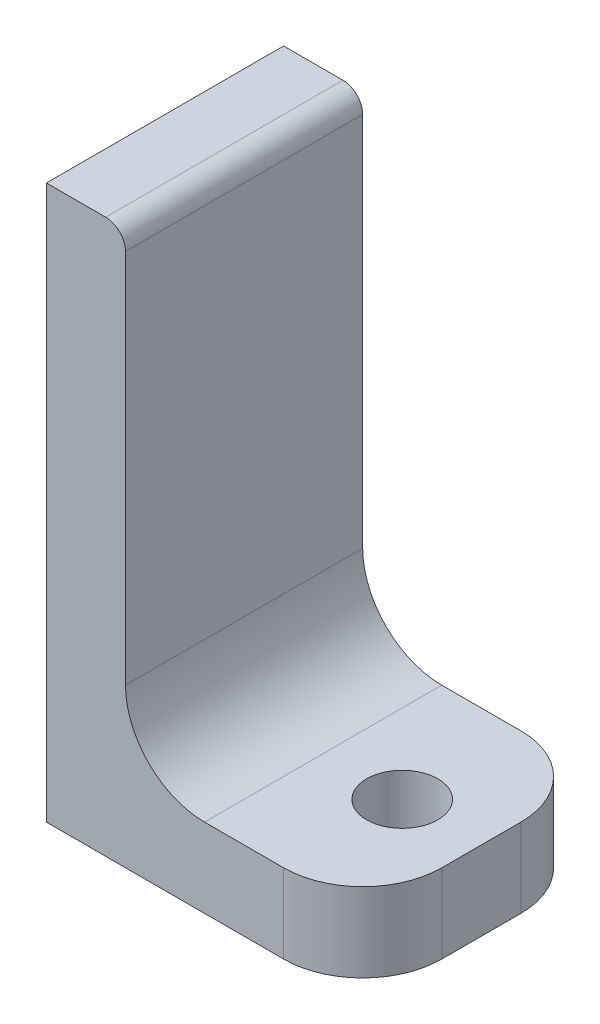
ISO-10303-21;
HEADER;
FILE_DESCRIPTION(('STEP AP214'),'2;1');
FILE_NAME('part.step','',(''),(''),'','','');
FILE_SCHEMA(('AUTOMOTIVE_DESIGN { 1 0 10303 214 1 1 1 1 }'));
ENDSEC;
DATA;
#1=APPLICATION_CONTEXT('core data for automotive mechanical design processes');
#2=APPLICATION_PROTOCOL_DEFINITION('international standard','automotive_design',2000,#1);
#3=PRODUCT_CONTEXT('',#1,'mechanical');
#4=PRODUCT('Part','Part','',(#3));
#5=PRODUCT_RELATED_PRODUCT_CATEGORY('part','',(#4));
#6=PRODUCT_DEFINITION_FORMATION('','',#4);
#7=PRODUCT_DEFINITION_CONTEXT('part definition',#1,'design');
#8=PRODUCT_DEFINITION('design','',#6,#7);
#9=PRODUCT_DEFINITION_SHAPE('','',#8);
#10=(LENGTH_UNIT() NAMED_UNIT(*) SI_UNIT(.MILLI.,.METRE.));
#11=(NAMED_UNIT(*) PLANE_ANGLE_UNIT() SI_UNIT($,.RADIAN.));
#12=(NAMED_UNIT(*) SI_UNIT($,.STERADIAN.) SOLID_ANGLE_UNIT());
#13=UNCERTAINTY_MEASURE_WITH_UNIT(LENGTH_MEASURE(1.E-05),#10,'distance_accuracy_value','');
#14=(GEOMETRIC_REPRESENTATION_CONTEXT(3) GLOBAL_UNCERTAINTY_ASSIGNED_CONTEXT((#13)) GLOBAL_UNIT_ASSIGNED_CONTEXT((#10,
#11,#12)) REPRESENTATION_CONTEXT('',''));
#15=CARTESIAN_POINT('',(0.,0.,0.));
#16=DIRECTION('',(0.,0.,1.));
#17=DIRECTION('',(1.,0.,0.));
#18=AXIS2_PLACEMENT_3D('',#15,#16,#17);
#19=CARTESIAN_POINT('',(0.,35.,15.));
#20=DIRECTION('',(0.,1.,0.));
#21=DIRECTION('',(0.,0.,1.));
#22=AXIS2_PLACEMENT_3D('',#19,#20,#21);
#23=PLANE('',#22);
#24=DIRECTION('',(1.,0.,0.));
#25=VECTOR('',#24,1.);
#26=CARTESIAN_POINT('',(0.,35.,0.));
#27=LINE('',#26,#25);
#28=CARTESIAN_POINT('',(0.,35.,0.));
#29=VERTEX_POINT('',#28);
#30=CARTESIAN_POINT('',(3.75,35.,0.));
#31=VERTEX_POINT('',#30);
#32=EDGE_CURVE('E166',#29,#31,#27,.T.);
#33=ORIENTED_EDGE('',*,*,#32,.F.);
#34=DIRECTION('',(0.,0.,-1.));
#35=VECTOR('',#34,1.);
#36=CARTESIAN_POINT('',(0.,35.,15.));
#37=LINE('',#36,#35);
#38=CARTESIAN_POINT('',(0.,35.,15.));
#39=VERTEX_POINT('',#38);
#40=EDGE_CURVE('E141',#39,#29,#37,.T.);
#41=ORIENTED_EDGE('',*,*,#40,.F.);
#42=DIRECTION('',(1.,0.,0.));
#43=VECTOR('',#42,1.);
#44=CARTESIAN_POINT('',(0.,35.,15.));
#45=LINE('',#44,#43);
#46=CARTESIAN_POINT('',(3.75,35.,15.));
#47=VERTEX_POINT('',#46);
#48=EDGE_CURVE('E121',#39,#47,#45,.T.);
#49=ORIENTED_EDGE('',*,*,#48,.T.);
#50=DIRECTION('',(0.,0.,-1.));
#51=VECTOR('',#50,1.);
#52=CARTESIAN_POINT('',(3.75,35.,15.));
#53=LINE('',#52,#51);
#54=EDGE_CURVE('E130',#47,#31,#53,.T.);
#55=ORIENTED_EDGE('',*,*,#54,.T.);
#56=EDGE_LOOP('',(#33,#41,#49,#55));
#57=FACE_BOUND('',#56,.T.);
#58=ADVANCED_FACE('F39',(#57),#23,.T.);
#59=CARTESIAN_POINT('',(0.,35.,15.));
#60=DIRECTION('',(1.,0.,0.));
#61=DIRECTION('',(0.,1.,0.));
#62=AXIS2_PLACEMENT_3D('',#59,#60,#61);
#63=PLANE('',#62);
#64=DIRECTION('',(0.,-1.,0.));
#65=VECTOR('',#64,1.);
#66=CARTESIAN_POINT('',(0.,35.,0.));
#67=LINE('',#66,#65);
#68=CARTESIAN_POINT('',(0.,0.,0.));
#69=VERTEX_POINT('',#68);
#70=EDGE_CURVE('E144',#29,#69,#67,.T.);
#71=ORIENTED_EDGE('',*,*,#70,.T.);
#72=DIRECTION('',(0.,0.,-1.));
#73=VECTOR('',#72,1.);
#74=CARTESIAN_POINT('',(0.,0.,15.));
#75=LINE('',#74,#73);
#76=CARTESIAN_POINT('',(0.,0.,15.));
#77=VERTEX_POINT('',#76);
#78=EDGE_CURVE('E186',#77,#69,#75,.T.);
#79=ORIENTED_EDGE('',*,*,#78,.F.);
#80=DIRECTION('',(0.,-1.,0.));
#81=VECTOR('',#80,1.);
#82=CARTESIAN_POINT('',(0.,35.,15.));
#83=LINE('',#82,#81);
#84=EDGE_CURVE('E139',#39,#77,#83,.T.);
#85=ORIENTED_EDGE('',*,*,#84,.F.);
#86=ORIENTED_EDGE('',*,*,#40,.T.);
#87=EDGE_LOOP('',(#71,#79,#85,#86));
#88=FACE_BOUND('',#87,.T.);
#89=ADVANCED_FACE('F247',(#88),#63,.F.);
#90=CARTESIAN_POINT('',(0.,0.,15.));
#91=DIRECTION('',(0.,1.,0.));
#92=DIRECTION('',(0.,0.,1.));
#93=AXIS2_PLACEMENT_3D('',#90,#91,#92);
#94=PLANE('',#93);
#95=CARTESIAN_POINT('',(15.,0.,7.5));
#96=DIRECTION('',(0.,1.,0.));
#97=DIRECTION('',(0.,0.,1.));
#98=AXIS2_PLACEMENT_3D('',#95,#96,#97);
#99=CIRCLE('',#98,2.25);
#100=CARTESIAN_POINT('',(15.,0.,9.75));
#101=VERTEX_POINT('',#100);
#102=EDGE_CURVE('E150',#101,#101,#99,.F.);
#103=ORIENTED_EDGE('',*,*,#102,.F.);
#104=EDGE_LOOP('',(#103));
#105=FACE_BOUND('',#104,.T.);
#106=DIRECTION('',(1.,0.,0.));
#107=VECTOR('',#106,1.);
#108=CARTESIAN_POINT('',(0.,0.,0.));
#109=LINE('',#108,#107);
#110=CARTESIAN_POINT('',(15.,0.,0.));
#111=VERTEX_POINT('',#110);
#112=EDGE_CURVE('E147',#69,#111,#109,.T.);
#113=ORIENTED_EDGE('',*,*,#112,.T.);
#114=CARTESIAN_POINT('',(15.,0.,5.));
#115=DIRECTION('',(0.,1.,0.));
#116=DIRECTION('',(0.,0.,1.));
#117=AXIS2_PLACEMENT_3D('',#114,#115,#116);
#118=CIRCLE('',#117,5.);
#119=CARTESIAN_POINT('',(20.,0.,5.));
#120=VERTEX_POINT('',#119);
#121=EDGE_CURVE('E212',#111,#120,#118,.F.);
#122=ORIENTED_EDGE('',*,*,#121,.T.);
#123=DIRECTION('',(0.,0.,-1.));
#124=VECTOR('',#123,1.);
#125=CARTESIAN_POINT('',(20.,0.,15.));
#126=LINE('',#125,#124);
#127=CARTESIAN_POINT('',(20.,0.,10.));
#128=VERTEX_POINT('',#127);
#129=EDGE_CURVE('E190',#128,#120,#126,.T.);
#130=ORIENTED_EDGE('',*,*,#129,.F.);
#131=CARTESIAN_POINT('',(15.,0.,10.));
#132=DIRECTION('',(0.,1.,0.));
#133=DIRECTION('',(0.,0.,1.));
#134=AXIS2_PLACEMENT_3D('',#131,#132,#133);
#135=CIRCLE('',#134,5.);
#136=CARTESIAN_POINT('',(15.,0.,15.));
#137=VERTEX_POINT('',#136);
#138=EDGE_CURVE('E209',#128,#137,#135,.F.);
#139=ORIENTED_EDGE('',*,*,#138,.T.);
#140=DIRECTION('',(1.,0.,0.));
#141=VECTOR('',#140,1.);
#142=CARTESIAN_POINT('',(0.,0.,15.));
#143=LINE('',#142,#141);
#144=EDGE_CURVE('E161',#77,#137,#143,.T.);
#145=ORIENTED_EDGE('',*,*,#144,.F.);
#146=ORIENTED_EDGE('',*,*,#78,.T.);
#147=EDGE_LOOP('',(#113,#122,#130,#139,#145,#146));
#148=FACE_BOUND('',#147,.T.);
#149=ADVANCED_FACE('F239',(#105,#148),#94,.F.);
#150=CARTESIAN_POINT('',(20.,5.,15.));
#151=DIRECTION('',(1.,0.,0.));
#152=DIRECTION('',(0.,0.,-1.));
#153=AXIS2_PLACEMENT_3D('',#150,#151,#152);
#154=PLANE('',#153);
#155=ORIENTED_EDGE('',*,*,#129,.T.);
#156=DIRECTION('',(0.,-1.,0.));
#157=VECTOR('',#156,1.);
#158=CARTESIAN_POINT('',(20.,5.,5.));
#159=LINE('',#158,#157);
#160=CARTESIAN_POINT('',(20.,5.,5.));
#161=VERTEX_POINT('',#160);
#162=EDGE_CURVE('E61',#120,#161,#159,.F.);
#163=ORIENTED_EDGE('',*,*,#162,.T.);
#164=DIRECTION('',(0.,0.,-1.));
#165=VECTOR('',#164,1.);
#166=CARTESIAN_POINT('',(20.,5.,15.));
#167=LINE('',#166,#165);
#168=CARTESIAN_POINT('',(20.,5.,10.));
#169=VERTEX_POINT('',#168);
#170=EDGE_CURVE('E193',#169,#161,#167,.T.);
#171=ORIENTED_EDGE('',*,*,#170,.F.);
#172=DIRECTION('',(0.,-1.,0.));
#173=VECTOR('',#172,1.);
#174=CARTESIAN_POINT('',(20.,5.,10.));
#175=LINE('',#174,#173);
#176=EDGE_CURVE('E215',#169,#128,#175,.T.);
#177=ORIENTED_EDGE('',*,*,#176,.T.);
#178=EDGE_LOOP('',(#155,#163,#171,#177));
#179=FACE_BOUND('',#178,.T.);
#180=ADVANCED_FACE('F240',(#179),#154,.T.);
#181=CARTESIAN_POINT('',(20.,5.,15.));
#182=DIRECTION('',(0.,-1.,0.));
#183=DIRECTION('',(1.,0.,0.));
#184=AXIS2_PLACEMENT_3D('',#181,#182,#183);
#185=PLANE('',#184);
#186=CARTESIAN_POINT('',(15.,5.,7.5));
#187=DIRECTION('',(0.,1.,0.));
#188=DIRECTION('',(-1.,0.,0.));
#189=AXIS2_PLACEMENT_3D('',#186,#187,#188);
#190=CIRCLE('',#189,2.25);
#191=CARTESIAN_POINT('',(12.75,5.,7.5));
#192=VERTEX_POINT('',#191);
#193=EDGE_CURVE('E366',#192,#192,#190,.T.);
#194=ORIENTED_EDGE('',*,*,#193,.F.);
#195=EDGE_LOOP('',(#194));
#196=FACE_BOUND('',#195,.T.);
#197=ORIENTED_EDGE('',*,*,#170,.T.);
#198=CARTESIAN_POINT('',(15.,5.,5.));
#199=DIRECTION('',(0.,-1.,0.));
#200=DIRECTION('',(1.,0.,0.));
#201=AXIS2_PLACEMENT_3D('',#198,#199,#200);
#202=CIRCLE('',#201,5.);
#203=CARTESIAN_POINT('',(15.,5.,0.));
#204=VERTEX_POINT('',#203);
#205=EDGE_CURVE('E48',#161,#204,#202,.F.);
#206=ORIENTED_EDGE('',*,*,#205,.T.);
#207=DIRECTION('',(-1.,0.,0.));
#208=VECTOR('',#207,1.);
#209=CARTESIAN_POINT('',(20.,5.,0.));
#210=LINE('',#209,#208);
#211=CARTESIAN_POINT('',(10.,5.,0.));
#212=VERTEX_POINT('',#211);
#213=EDGE_CURVE('E177',#204,#212,#210,.T.);
#214=ORIENTED_EDGE('',*,*,#213,.T.);
#215=DIRECTION('',(0.,0.,-1.));
#216=VECTOR('',#215,1.);
#217=CARTESIAN_POINT('',(10.,5.,15.));
#218=LINE('',#217,#216);
#219=CARTESIAN_POINT('',(10.,5.,15.));
#220=VERTEX_POINT('',#219);
#221=EDGE_CURVE('E196',#220,#212,#218,.T.);
#222=ORIENTED_EDGE('',*,*,#221,.F.);
#223=DIRECTION('',(-1.,0.,0.));
#224=VECTOR('',#223,1.);
#225=CARTESIAN_POINT('',(20.,5.,15.));
#226=LINE('',#225,#224);
#227=CARTESIAN_POINT('',(15.,5.,15.));
#228=VERTEX_POINT('',#227);
#229=EDGE_CURVE('E158',#228,#220,#226,.T.);
#230=ORIENTED_EDGE('',*,*,#229,.F.);
#231=CARTESIAN_POINT('',(15.,5.,10.));
#232=DIRECTION('',(0.,-1.,0.));
#233=DIRECTION('',(1.,0.,0.));
#234=AXIS2_PLACEMENT_3D('',#231,#232,#233);
#235=CIRCLE('',#234,5.);
#236=EDGE_CURVE('E221',#228,#169,#235,.F.);
#237=ORIENTED_EDGE('',*,*,#236,.T.);
#238=EDGE_LOOP('',(#197,#206,#214,#222,#230,#237));
#239=FACE_BOUND('',#238,.T.);
#240=ADVANCED_FACE('F227',(#196,#239),#185,.F.);
#241=CARTESIAN_POINT('',(10.,10.,15.));
#242=DIRECTION('',(0.,0.,-1.));
#243=DIRECTION('',(-1.,0.,0.));
#244=AXIS2_PLACEMENT_3D('',#241,#242,#243);
#245=CYLINDRICAL_SURFACE('',#244,5.);
#246=CARTESIAN_POINT('',(10.,10.,0.));
#247=DIRECTION('',(0.,0.,-1.));
#248=DIRECTION('',(-1.,0.,0.));
#249=AXIS2_PLACEMENT_3D('',#246,#247,#248);
#250=CIRCLE('',#249,5.);
#251=CARTESIAN_POINT('',(5.,10.,0.));
#252=VERTEX_POINT('',#251);
#253=EDGE_CURVE('E174',#212,#252,#250,.T.);
#254=ORIENTED_EDGE('',*,*,#253,.T.);
#255=DIRECTION('',(0.,0.,-1.));
#256=VECTOR('',#255,1.);
#257=CARTESIAN_POINT('',(5.,10.,15.));
#258=LINE('',#257,#256);
#259=CARTESIAN_POINT('',(5.,10.,15.));
#260=VERTEX_POINT('',#259);
#261=EDGE_CURVE('E200',#260,#252,#258,.T.);
#262=ORIENTED_EDGE('',*,*,#261,.F.);
#263=CARTESIAN_POINT('',(10.,10.,15.));
#264=DIRECTION('',(0.,0.,-1.));
#265=DIRECTION('',(-1.,0.,0.));
#266=AXIS2_PLACEMENT_3D('',#263,#264,#265);
#267=CIRCLE('',#266,5.);
#268=EDGE_CURVE('E155',#220,#260,#267,.T.);
#269=ORIENTED_EDGE('',*,*,#268,.F.);
#270=ORIENTED_EDGE('',*,*,#221,.T.);
#271=EDGE_LOOP('',(#254,#262,#269,#270));
#272=FACE_BOUND('',#271,.T.);
#273=ADVANCED_FACE('F254',(#272),#245,.F.);
#274=CARTESIAN_POINT('',(5.,10.,15.));
#275=DIRECTION('',(-1.,0.,0.));
#276=DIRECTION('',(0.,-1.,0.));
#277=AXIS2_PLACEMENT_3D('',#274,#275,#276);
#278=PLANE('',#277);
#279=DIRECTION('',(0.,1.,0.));
#280=VECTOR('',#279,1.);
#281=CARTESIAN_POINT('',(5.,10.,0.));
#282=LINE('',#281,#280);
#283=CARTESIAN_POINT('',(5.,33.75,0.));
#284=VERTEX_POINT('',#283);
#285=EDGE_CURVE('E171',#252,#284,#282,.T.);
#286=ORIENTED_EDGE('',*,*,#285,.T.);
#287=DIRECTION('',(0.,0.,-1.));
#288=VECTOR('',#287,1.);
#289=CARTESIAN_POINT('',(5.,33.75,15.));
#290=LINE('',#289,#288);
#291=CARTESIAN_POINT('',(5.,33.75,15.));
#292=VERTEX_POINT('',#291);
#293=EDGE_CURVE('E138',#292,#284,#290,.T.);
#294=ORIENTED_EDGE('',*,*,#293,.F.);
#295=DIRECTION('',(0.,1.,0.));
#296=VECTOR('',#295,1.);
#297=CARTESIAN_POINT('',(5.,10.,15.));
#298=LINE('',#297,#296);
#299=EDGE_CURVE('E123',#260,#292,#298,.T.);
#300=ORIENTED_EDGE('',*,*,#299,.F.);
#301=ORIENTED_EDGE('',*,*,#261,.T.);
#302=EDGE_LOOP('',(#286,#294,#300,#301));
#303=FACE_BOUND('',#302,.T.);
#304=ADVANCED_FACE('F250',(#303),#278,.F.);
#305=CARTESIAN_POINT('',(3.75,33.75,15.));
#306=DIRECTION('',(0.,0.,-1.));
#307=DIRECTION('',(-1.,0.,0.));
#308=AXIS2_PLACEMENT_3D('',#305,#306,#307);
#309=CYLINDRICAL_SURFACE('',#308,1.25);
#310=CARTESIAN_POINT('',(3.75,33.75,0.));
#311=DIRECTION('',(0.,0.,1.));
#312=DIRECTION('',(1.,0.,0.));
#313=AXIS2_PLACEMENT_3D('',#310,#311,#312);
#314=CIRCLE('',#313,1.25);
#315=EDGE_CURVE('E133',#284,#31,#314,.T.);
#316=ORIENTED_EDGE('',*,*,#315,.T.);
#317=ORIENTED_EDGE('',*,*,#54,.F.);
#318=CARTESIAN_POINT('',(3.75,33.75,15.));
#319=DIRECTION('',(0.,0.,1.));
#320=DIRECTION('',(1.,0.,0.));
#321=AXIS2_PLACEMENT_3D('',#318,#319,#320);
#322=CIRCLE('',#321,1.25);
#323=EDGE_CURVE('E117',#292,#47,#322,.T.);
#324=ORIENTED_EDGE('',*,*,#323,.F.);
#325=ORIENTED_EDGE('',*,*,#293,.T.);
#326=EDGE_LOOP('',(#316,#317,#324,#325));
#327=FACE_BOUND('',#326,.T.);
#328=ADVANCED_FACE('F131',(#327),#309,.T.);
#329=CARTESIAN_POINT('',(3.75,33.75,15.));
#330=DIRECTION('',(0.,0.,1.));
#331=DIRECTION('',(1.,0.,0.));
#332=AXIS2_PLACEMENT_3D('',#329,#330,#331);
#333=PLANE('',#332);
#334=ORIENTED_EDGE('',*,*,#144,.T.);
#335=DIRECTION('',(0.,-1.,0.));
#336=VECTOR('',#335,1.);
#337=CARTESIAN_POINT('',(15.,33.75,15.));
#338=LINE('',#337,#336);
#339=EDGE_CURVE('E11',#137,#228,#338,.F.);
#340=ORIENTED_EDGE('',*,*,#339,.T.);
#341=ORIENTED_EDGE('',*,*,#229,.T.);
#342=ORIENTED_EDGE('',*,*,#268,.T.);
#343=ORIENTED_EDGE('',*,*,#299,.T.);
#344=ORIENTED_EDGE('',*,*,#323,.T.);
#345=ORIENTED_EDGE('',*,*,#48,.F.);
#346=ORIENTED_EDGE('',*,*,#84,.T.);
#347=EDGE_LOOP('',(#334,#340,#341,#342,#343,#344,#345,#346));
#348=FACE_BOUND('',#347,.T.);
#349=ADVANCED_FACE('F119',(#348),#333,.T.);
#350=CARTESIAN_POINT('',(3.75,33.75,0.));
#351=DIRECTION('',(0.,0.,1.));
#352=DIRECTION('',(1.,0.,0.));
#353=AXIS2_PLACEMENT_3D('',#350,#351,#352);
#354=PLANE('',#353);
#355=ORIENTED_EDGE('',*,*,#213,.F.);
#356=DIRECTION('',(0.,-1.,0.));
#357=VECTOR('',#356,1.);
#358=CARTESIAN_POINT('',(15.,0.,0.));
#359=LINE('',#358,#357);
#360=EDGE_CURVE('E185',#204,#111,#359,.T.);
#361=ORIENTED_EDGE('',*,*,#360,.T.);
#362=ORIENTED_EDGE('',*,*,#112,.F.);
#363=ORIENTED_EDGE('',*,*,#70,.F.);
#364=ORIENTED_EDGE('',*,*,#32,.T.);
#365=ORIENTED_EDGE('',*,*,#315,.F.);
#366=ORIENTED_EDGE('',*,*,#285,.F.);
#367=ORIENTED_EDGE('',*,*,#253,.F.);
#368=EDGE_LOOP('',(#355,#361,#362,#363,#364,#365,#366,#367));
#369=FACE_BOUND('',#368,.T.);
#370=ADVANCED_FACE('F233',(#369),#354,.F.);
#371=CARTESIAN_POINT('',(15.,-0.001000000000001,7.5));
#372=DIRECTION('',(0.,1.,0.));
#373=DIRECTION('',(-1.,0.,0.));
#374=AXIS2_PLACEMENT_3D('',#371,#372,#373);
#375=CYLINDRICAL_SURFACE('',#374,2.25);
#376=ORIENTED_EDGE('',*,*,#193,.T.);
#377=EDGE_LOOP('',(#376));
#378=FACE_BOUND('',#377,.T.);
#379=ORIENTED_EDGE('',*,*,#102,.T.);
#380=EDGE_LOOP('',(#379));
#381=FACE_BOUND('',#380,.T.);
#382=ADVANCED_FACE('F272',(#378,#381),#375,.F.);
#383=CARTESIAN_POINT('',(15.,33.75,5.));
#384=DIRECTION('',(0.,1.,0.));
#385=DIRECTION('',(0.,0.,1.));
#386=AXIS2_PLACEMENT_3D('',#383,#384,#385);
#387=CYLINDRICAL_SURFACE('',#386,5.);
#388=ORIENTED_EDGE('',*,*,#205,.F.);
#389=ORIENTED_EDGE('',*,*,#162,.F.);
#390=ORIENTED_EDGE('',*,*,#121,.F.);
#391=ORIENTED_EDGE('',*,*,#360,.F.);
#392=EDGE_LOOP('',(#388,#389,#390,#391));
#393=FACE_BOUND('',#392,.T.);
#394=ADVANCED_FACE('F236',(#393),#387,.T.);
#395=CARTESIAN_POINT('',(15.,5.,10.));
#396=DIRECTION('',(0.,-1.,0.));
#397=DIRECTION('',(0.,0.,-1.));
#398=AXIS2_PLACEMENT_3D('',#395,#396,#397);
#399=CYLINDRICAL_SURFACE('',#398,5.);
#400=ORIENTED_EDGE('',*,*,#236,.F.);
#401=ORIENTED_EDGE('',*,*,#339,.F.);
#402=ORIENTED_EDGE('',*,*,#138,.F.);
#403=ORIENTED_EDGE('',*,*,#176,.F.);
#404=EDGE_LOOP('',(#400,#401,#402,#403));
#405=FACE_BOUND('',#404,.T.);
#406=ADVANCED_FACE('F41',(#405),#399,.T.);
#407=CLOSED_SHELL('',(#58,#89,#149,#180,#240,#273,#304,#328,#349,#370,#382,#394,#406));
#408=MANIFOLD_SOLID_BREP('B2',#407);
#409=ADVANCED_BREP_SHAPE_REPRESENTATION('',(#18,#408),#14);
#410=SHAPE_DEFINITION_REPRESENTATION(#9,#409);
ENDSEC;
END-ISO-10303-21;
